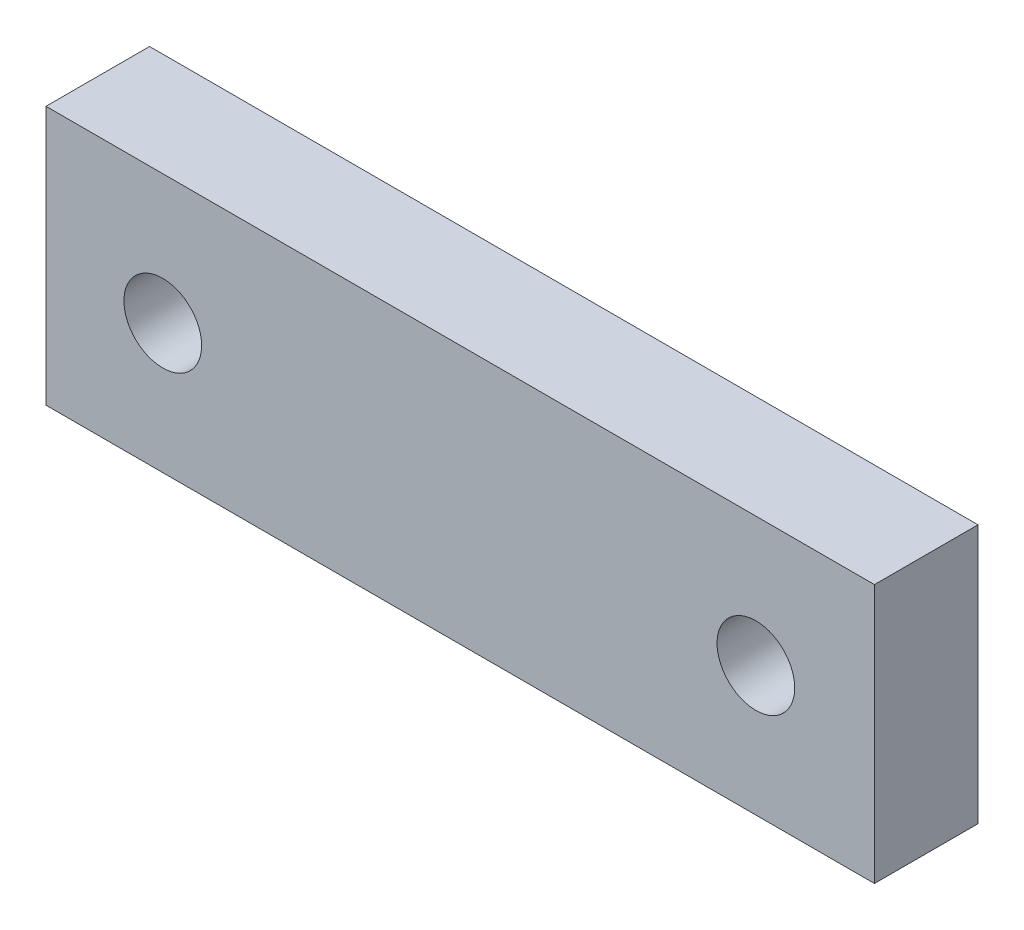
ISO-10303-21;
HEADER;
FILE_DESCRIPTION(('STEP AP214'),'2;1');
FILE_NAME('part.step','',(''),(''),'','','');
FILE_SCHEMA(('AUTOMOTIVE_DESIGN { 1 0 10303 214 1 1 1 1 }'));
ENDSEC;
DATA;
#1=APPLICATION_CONTEXT('core data for automotive mechanical design processes');
#2=APPLICATION_PROTOCOL_DEFINITION('international standard','automotive_design',2000,#1);
#3=PRODUCT_CONTEXT('',#1,'mechanical');
#4=PRODUCT('Part','Part','',(#3));
#5=PRODUCT_RELATED_PRODUCT_CATEGORY('part','',(#4));
#6=PRODUCT_DEFINITION_FORMATION('','',#4);
#7=PRODUCT_DEFINITION_CONTEXT('part definition',#1,'design');
#8=PRODUCT_DEFINITION('design','',#6,#7);
#9=PRODUCT_DEFINITION_SHAPE('','',#8);
#10=(LENGTH_UNIT() NAMED_UNIT(*) SI_UNIT(.MILLI.,.METRE.));
#11=(NAMED_UNIT(*) PLANE_ANGLE_UNIT() SI_UNIT($,.RADIAN.));
#12=(NAMED_UNIT(*) SI_UNIT($,.STERADIAN.) SOLID_ANGLE_UNIT());
#13=UNCERTAINTY_MEASURE_WITH_UNIT(LENGTH_MEASURE(1.E-05),#10,'distance_accuracy_value','');
#14=(GEOMETRIC_REPRESENTATION_CONTEXT(3) GLOBAL_UNCERTAINTY_ASSIGNED_CONTEXT((#13)) GLOBAL_UNIT_ASSIGNED_CONTEXT((#10,
#11,#12)) REPRESENTATION_CONTEXT('',''));
#15=CARTESIAN_POINT('',(0.,0.,0.));
#16=DIRECTION('',(0.,0.,1.));
#17=DIRECTION('',(1.,0.,0.));
#18=AXIS2_PLACEMENT_3D('',#15,#16,#17);
#19=CARTESIAN_POINT('',(0.,0.,4.));
#20=DIRECTION('',(1.,0.,0.));
#21=DIRECTION('',(0.,1.,0.));
#22=AXIS2_PLACEMENT_3D('',#19,#20,#21);
#23=PLANE('',#22);
#24=DIRECTION('',(0.,-1.,0.));
#25=VECTOR('',#24,1.);
#26=CARTESIAN_POINT('',(0.,0.,0.));
#27=LINE('',#26,#25);
#28=CARTESIAN_POINT('',(0.,0.,0.));
#29=VERTEX_POINT('',#28);
#30=CARTESIAN_POINT('',(0.,-10.,0.));
#31=VERTEX_POINT('',#30);
#32=EDGE_CURVE('E98',#29,#31,#27,.T.);
#33=ORIENTED_EDGE('',*,*,#32,.T.);
#34=DIRECTION('',(0.,0.,-1.));
#35=VECTOR('',#34,1.);
#36=CARTESIAN_POINT('',(0.,-10.,4.));
#37=LINE('',#36,#35);
#38=CARTESIAN_POINT('',(0.,-10.,4.));
#39=VERTEX_POINT('',#38);
#40=EDGE_CURVE('E11',#39,#31,#37,.T.);
#41=ORIENTED_EDGE('',*,*,#40,.F.);
#42=DIRECTION('',(0.,-1.,0.));
#43=VECTOR('',#42,1.);
#44=CARTESIAN_POINT('',(0.,0.,4.));
#45=LINE('',#44,#43);
#46=CARTESIAN_POINT('',(0.,0.,4.));
#47=VERTEX_POINT('',#46);
#48=EDGE_CURVE('E86',#47,#39,#45,.T.);
#49=ORIENTED_EDGE('',*,*,#48,.F.);
#50=DIRECTION('',(0.,0.,-1.));
#51=VECTOR('',#50,1.);
#52=CARTESIAN_POINT('',(0.,0.,4.));
#53=LINE('',#52,#51);
#54=EDGE_CURVE('E94',#47,#29,#53,.T.);
#55=ORIENTED_EDGE('',*,*,#54,.T.);
#56=EDGE_LOOP('',(#33,#41,#49,#55));
#57=FACE_BOUND('',#56,.T.);
#58=ADVANCED_FACE('F35',(#57),#23,.F.);
#59=CARTESIAN_POINT('',(0.,-10.,4.));
#60=DIRECTION('',(0.,1.,0.));
#61=DIRECTION('',(0.,0.,1.));
#62=AXIS2_PLACEMENT_3D('',#59,#60,#61);
#63=PLANE('',#62);
#64=DIRECTION('',(1.,0.,0.));
#65=VECTOR('',#64,1.);
#66=CARTESIAN_POINT('',(0.,-10.,0.));
#67=LINE('',#66,#65);
#68=CARTESIAN_POINT('',(32.,-10.,0.));
#69=VERTEX_POINT('',#68);
#70=EDGE_CURVE('E90',#31,#69,#67,.T.);
#71=ORIENTED_EDGE('',*,*,#70,.T.);
#72=DIRECTION('',(0.,0.,-1.));
#73=VECTOR('',#72,1.);
#74=CARTESIAN_POINT('',(32.,-10.,4.));
#75=LINE('',#74,#73);
#76=CARTESIAN_POINT('',(32.,-10.,4.));
#77=VERTEX_POINT('',#76);
#78=EDGE_CURVE('E43',#77,#69,#75,.T.);
#79=ORIENTED_EDGE('',*,*,#78,.F.);
#80=DIRECTION('',(1.,0.,0.));
#81=VECTOR('',#80,1.);
#82=CARTESIAN_POINT('',(0.,-10.,4.));
#83=LINE('',#82,#81);
#84=EDGE_CURVE('E81',#39,#77,#83,.T.);
#85=ORIENTED_EDGE('',*,*,#84,.F.);
#86=ORIENTED_EDGE('',*,*,#40,.T.);
#87=EDGE_LOOP('',(#71,#79,#85,#86));
#88=FACE_BOUND('',#87,.T.);
#89=ADVANCED_FACE('F89',(#88),#63,.F.);
#90=CARTESIAN_POINT('',(32.,0.,4.));
#91=DIRECTION('',(-1.,0.,0.));
#92=DIRECTION('',(0.,0.,1.));
#93=AXIS2_PLACEMENT_3D('',#90,#91,#92);
#94=PLANE('',#93);
#95=DIRECTION('',(0.,1.,0.));
#96=VECTOR('',#95,1.);
#97=CARTESIAN_POINT('',(32.,0.,0.));
#98=LINE('',#97,#96);
#99=CARTESIAN_POINT('',(32.,0.,0.));
#100=VERTEX_POINT('',#99);
#101=EDGE_CURVE('E68',#69,#100,#98,.T.);
#102=ORIENTED_EDGE('',*,*,#101,.T.);
#103=DIRECTION('',(0.,0.,-1.));
#104=VECTOR('',#103,1.);
#105=CARTESIAN_POINT('',(32.,0.,4.));
#106=LINE('',#105,#104);
#107=CARTESIAN_POINT('',(32.,0.,4.));
#108=VERTEX_POINT('',#107);
#109=EDGE_CURVE('E91',#108,#100,#106,.T.);
#110=ORIENTED_EDGE('',*,*,#109,.F.);
#111=DIRECTION('',(0.,1.,0.));
#112=VECTOR('',#111,1.);
#113=CARTESIAN_POINT('',(32.,0.,4.));
#114=LINE('',#113,#112);
#115=EDGE_CURVE('E84',#77,#108,#114,.T.);
#116=ORIENTED_EDGE('',*,*,#115,.F.);
#117=ORIENTED_EDGE('',*,*,#78,.T.);
#118=EDGE_LOOP('',(#102,#110,#116,#117));
#119=FACE_BOUND('',#118,.T.);
#120=ADVANCED_FACE('F92',(#119),#94,.F.);
#121=CARTESIAN_POINT('',(0.,0.,4.));
#122=DIRECTION('',(0.,-1.,0.));
#123=DIRECTION('',(0.,0.,-1.));
#124=AXIS2_PLACEMENT_3D('',#121,#122,#123);
#125=PLANE('',#124);
#126=DIRECTION('',(-1.,0.,0.));
#127=VECTOR('',#126,1.);
#128=CARTESIAN_POINT('',(0.,0.,0.));
#129=LINE('',#128,#127);
#130=EDGE_CURVE('E74',#100,#29,#129,.T.);
#131=ORIENTED_EDGE('',*,*,#130,.T.);
#132=ORIENTED_EDGE('',*,*,#54,.F.);
#133=DIRECTION('',(-1.,0.,0.));
#134=VECTOR('',#133,1.);
#135=CARTESIAN_POINT('',(0.,0.,4.));
#136=LINE('',#135,#134);
#137=EDGE_CURVE('E51',#108,#47,#136,.T.);
#138=ORIENTED_EDGE('',*,*,#137,.F.);
#139=ORIENTED_EDGE('',*,*,#109,.T.);
#140=EDGE_LOOP('',(#131,#132,#138,#139));
#141=FACE_BOUND('',#140,.T.);
#142=ADVANCED_FACE('F106',(#141),#125,.F.);
#143=CARTESIAN_POINT('',(0.,0.,4.));
#144=DIRECTION('',(0.,0.,1.));
#145=DIRECTION('',(1.,0.,0.));
#146=AXIS2_PLACEMENT_3D('',#143,#144,#145);
#147=PLANE('',#146);
#148=CARTESIAN_POINT('',(4.51,-5.,4.));
#149=DIRECTION('',(0.,0.,1.));
#150=DIRECTION('',(1.,0.,0.));
#151=AXIS2_PLACEMENT_3D('',#148,#149,#150);
#152=CIRCLE('',#151,1.5);
#153=CARTESIAN_POINT('',(6.01,-5.,4.));
#154=VERTEX_POINT('',#153);
#155=EDGE_CURVE('E118',#154,#154,#152,.T.);
#156=ORIENTED_EDGE('',*,*,#155,.F.);
#157=EDGE_LOOP('',(#156));
#158=FACE_BOUND('',#157,.T.);
#159=CARTESIAN_POINT('',(27.42,-5.,4.));
#160=DIRECTION('',(0.,0.,1.));
#161=DIRECTION('',(1.,0.,0.));
#162=AXIS2_PLACEMENT_3D('',#159,#160,#161);
#163=CIRCLE('',#162,1.5);
#164=CARTESIAN_POINT('',(28.92,-5.,4.));
#165=VERTEX_POINT('',#164);
#166=EDGE_CURVE('E112',#165,#165,#163,.T.);
#167=ORIENTED_EDGE('',*,*,#166,.F.);
#168=EDGE_LOOP('',(#167));
#169=FACE_BOUND('',#168,.T.);
#170=ORIENTED_EDGE('',*,*,#48,.T.);
#171=ORIENTED_EDGE('',*,*,#84,.T.);
#172=ORIENTED_EDGE('',*,*,#115,.T.);
#173=ORIENTED_EDGE('',*,*,#137,.T.);
#174=EDGE_LOOP('',(#170,#171,#172,#173));
#175=FACE_BOUND('',#174,.T.);
#176=ADVANCED_FACE('F82',(#158,#169,#175),#147,.T.);
#177=CARTESIAN_POINT('',(0.,0.,0.));
#178=DIRECTION('',(0.,0.,1.));
#179=DIRECTION('',(1.,0.,0.));
#180=AXIS2_PLACEMENT_3D('',#177,#178,#179);
#181=PLANE('',#180);
#182=CARTESIAN_POINT('',(4.51,-5.,0.));
#183=DIRECTION('',(0.,0.,1.));
#184=DIRECTION('',(1.,0.,0.));
#185=AXIS2_PLACEMENT_3D('',#182,#183,#184);
#186=CIRCLE('',#185,1.5);
#187=CARTESIAN_POINT('',(6.01,-5.,0.));
#188=VERTEX_POINT('',#187);
#189=EDGE_CURVE('E101',#188,#188,#186,.T.);
#190=ORIENTED_EDGE('',*,*,#189,.T.);
#191=EDGE_LOOP('',(#190));
#192=FACE_BOUND('',#191,.T.);
#193=CARTESIAN_POINT('',(27.42,-5.,0.));
#194=DIRECTION('',(0.,0.,1.));
#195=DIRECTION('',(1.,0.,0.));
#196=AXIS2_PLACEMENT_3D('',#193,#194,#195);
#197=CIRCLE('',#196,1.5);
#198=CARTESIAN_POINT('',(28.92,-5.,0.));
#199=VERTEX_POINT('',#198);
#200=EDGE_CURVE('E115',#199,#199,#197,.T.);
#201=ORIENTED_EDGE('',*,*,#200,.T.);
#202=EDGE_LOOP('',(#201));
#203=FACE_BOUND('',#202,.T.);
#204=ORIENTED_EDGE('',*,*,#32,.F.);
#205=ORIENTED_EDGE('',*,*,#130,.F.);
#206=ORIENTED_EDGE('',*,*,#101,.F.);
#207=ORIENTED_EDGE('',*,*,#70,.F.);
#208=EDGE_LOOP('',(#204,#205,#206,#207));
#209=FACE_BOUND('',#208,.T.);
#210=ADVANCED_FACE('F109',(#192,#203,#209),#181,.F.);
#211=CARTESIAN_POINT('',(27.42,-5.,0.));
#212=DIRECTION('',(0.,0.,1.));
#213=DIRECTION('',(1.,0.,0.));
#214=AXIS2_PLACEMENT_3D('',#211,#212,#213);
#215=CYLINDRICAL_SURFACE('',#214,1.5);
#216=ORIENTED_EDGE('',*,*,#200,.F.);
#217=EDGE_LOOP('',(#216));
#218=FACE_BOUND('',#217,.T.);
#219=ORIENTED_EDGE('',*,*,#166,.T.);
#220=EDGE_LOOP('',(#219));
#221=FACE_BOUND('',#220,.T.);
#222=ADVANCED_FACE('F129',(#218,#221),#215,.F.);
#223=CARTESIAN_POINT('',(4.51,-5.,0.));
#224=DIRECTION('',(0.,0.,1.));
#225=DIRECTION('',(1.,0.,0.));
#226=AXIS2_PLACEMENT_3D('',#223,#224,#225);
#227=CYLINDRICAL_SURFACE('',#226,1.5);
#228=ORIENTED_EDGE('',*,*,#189,.F.);
#229=EDGE_LOOP('',(#228));
#230=FACE_BOUND('',#229,.T.);
#231=ORIENTED_EDGE('',*,*,#155,.T.);
#232=EDGE_LOOP('',(#231));
#233=FACE_BOUND('',#232,.T.);
#234=ADVANCED_FACE('F126',(#230,#233),#227,.F.);
#235=CLOSED_SHELL('',(#58,#89,#120,#142,#176,#210,#222,#234));
#236=MANIFOLD_SOLID_BREP('B2',#235);
#237=ADVANCED_BREP_SHAPE_REPRESENTATION('',(#18,#236),#14);
#238=SHAPE_DEFINITION_REPRESENTATION(#9,#237);
ENDSEC;
END-ISO-10303-21;
